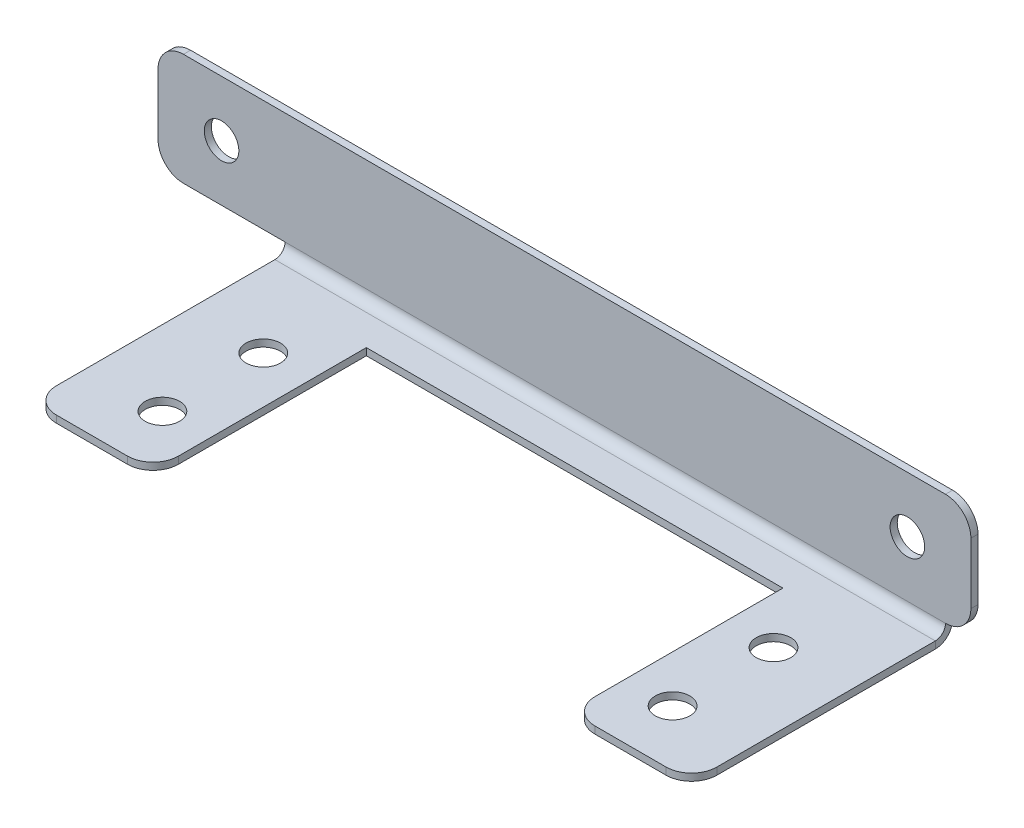
ISO-10303-21;
HEADER;
FILE_DESCRIPTION(('STEP AP214'),'2;1');
FILE_NAME('part.step','',(''),(''),'','','');
FILE_SCHEMA(('AUTOMOTIVE_DESIGN { 1 0 10303 214 1 1 1 1 }'));
ENDSEC;
DATA;
#1=APPLICATION_CONTEXT('core data for automotive mechanical design processes');
#2=APPLICATION_PROTOCOL_DEFINITION('international standard','automotive_design',2000,#1);
#3=PRODUCT_CONTEXT('',#1,'mechanical');
#4=PRODUCT('Part','Part','',(#3));
#5=PRODUCT_RELATED_PRODUCT_CATEGORY('part','',(#4));
#6=PRODUCT_DEFINITION_FORMATION('','',#4);
#7=PRODUCT_DEFINITION_CONTEXT('part definition',#1,'design');
#8=PRODUCT_DEFINITION('design','',#6,#7);
#9=PRODUCT_DEFINITION_SHAPE('','',#8);
#10=(LENGTH_UNIT() NAMED_UNIT(*) SI_UNIT(.MILLI.,.METRE.));
#11=(NAMED_UNIT(*) PLANE_ANGLE_UNIT() SI_UNIT($,.RADIAN.));
#12=(NAMED_UNIT(*) SI_UNIT($,.STERADIAN.) SOLID_ANGLE_UNIT());
#13=UNCERTAINTY_MEASURE_WITH_UNIT(LENGTH_MEASURE(1.E-05),#10,'distance_accuracy_value','');
#14=(GEOMETRIC_REPRESENTATION_CONTEXT(3) GLOBAL_UNCERTAINTY_ASSIGNED_CONTEXT((#13)) GLOBAL_UNIT_ASSIGNED_CONTEXT((#10,
#11,#12)) REPRESENTATION_CONTEXT('',''));
#15=CARTESIAN_POINT('',(0.,0.,0.));
#16=DIRECTION('',(0.,0.,1.));
#17=DIRECTION('',(1.,0.,0.));
#18=AXIS2_PLACEMENT_3D('',#15,#16,#17);
#19=CARTESIAN_POINT('',(-32.5,-0.7,12.));
#20=DIRECTION('',(0.,0.,1.));
#21=DIRECTION('',(1.,0.,0.));
#22=AXIS2_PLACEMENT_3D('',#19,#20,#21);
#23=PLANE('',#22);
#24=DIRECTION('',(1.,0.,0.));
#25=VECTOR('',#24,1.);
#26=CARTESIAN_POINT('',(-32.5,-0.7,12.));
#27=LINE('',#26,#25);
#28=CARTESIAN_POINT('',(-30.,-0.7,12.));
#29=VERTEX_POINT('',#28);
#30=CARTESIAN_POINT('',(-23.,-0.7,12.));
#31=VERTEX_POINT('',#30);
#32=EDGE_CURVE('E300',#29,#31,#27,.T.);
#33=ORIENTED_EDGE('',*,*,#32,.T.);
#34=DIRECTION('',(0.,1.,0.));
#35=VECTOR('',#34,1.);
#36=CARTESIAN_POINT('',(-23.,0.,12.));
#37=LINE('',#36,#35);
#38=CARTESIAN_POINT('',(-23.,0.,12.));
#39=VERTEX_POINT('',#38);
#40=EDGE_CURVE('E319',#31,#39,#37,.T.);
#41=ORIENTED_EDGE('',*,*,#40,.T.);
#42=DIRECTION('',(1.,0.,0.));
#43=VECTOR('',#42,1.);
#44=CARTESIAN_POINT('',(-32.5,0.,12.));
#45=LINE('',#44,#43);
#46=CARTESIAN_POINT('',(-30.,0.,12.));
#47=VERTEX_POINT('',#46);
#48=EDGE_CURVE('E291',#47,#39,#45,.T.);
#49=ORIENTED_EDGE('',*,*,#48,.F.);
#50=DIRECTION('',(0.,1.,0.));
#51=VECTOR('',#50,1.);
#52=CARTESIAN_POINT('',(-30.,-0.7,12.));
#53=LINE('',#52,#51);
#54=EDGE_CURVE('E314',#47,#29,#53,.F.);
#55=ORIENTED_EDGE('',*,*,#54,.T.);
#56=EDGE_LOOP('',(#33,#41,#49,#55));
#57=FACE_BOUND('',#56,.T.);
#58=ADVANCED_FACE('F56',(#57),#23,.T.);
#59=CARTESIAN_POINT('',(32.5,-0.7,-12.));
#60=DIRECTION('',(1.,0.,0.));
#61=DIRECTION('',(0.,0.,-1.));
#62=AXIS2_PLACEMENT_3D('',#59,#60,#61);
#63=PLANE('',#62);
#64=DIRECTION('',(0.,0.,-1.));
#65=VECTOR('',#64,1.);
#66=CARTESIAN_POINT('',(32.5,0.,-12.));
#67=LINE('',#66,#65);
#68=CARTESIAN_POINT('',(32.5,0.,9.5));
#69=VERTEX_POINT('',#68);
#70=CARTESIAN_POINT('',(32.5,0.,-12.));
#71=VERTEX_POINT('',#70);
#72=EDGE_CURVE('E279',#69,#71,#67,.T.);
#73=ORIENTED_EDGE('',*,*,#72,.F.);
#74=DIRECTION('',(0.,1.,0.));
#75=VECTOR('',#74,1.);
#76=CARTESIAN_POINT('',(32.5,-0.7,9.5));
#77=LINE('',#76,#75);
#78=CARTESIAN_POINT('',(32.5,-0.7,9.5));
#79=VERTEX_POINT('',#78);
#80=EDGE_CURVE('E348',#69,#79,#77,.F.);
#81=ORIENTED_EDGE('',*,*,#80,.T.);
#82=DIRECTION('',(0.,0.,-1.));
#83=VECTOR('',#82,1.);
#84=CARTESIAN_POINT('',(32.5,-0.7,-12.));
#85=LINE('',#84,#83);
#86=CARTESIAN_POINT('',(32.5,-0.7,-12.));
#87=VERTEX_POINT('',#86);
#88=EDGE_CURVE('E288',#79,#87,#85,.T.);
#89=ORIENTED_EDGE('',*,*,#88,.T.);
#90=DIRECTION('',(0.,1.,0.));
#91=VECTOR('',#90,1.);
#92=CARTESIAN_POINT('',(32.5,-0.7,-12.));
#93=LINE('',#92,#91);
#94=EDGE_CURVE('E315',#87,#71,#93,.T.);
#95=ORIENTED_EDGE('',*,*,#94,.T.);
#96=EDGE_LOOP('',(#73,#81,#89,#95));
#97=FACE_BOUND('',#96,.T.);
#98=ADVANCED_FACE('F432',(#97),#63,.T.);
#99=CARTESIAN_POINT('',(23.,-0.7,12.));
#100=VERTEX_POINT('',#99);
#101=CARTESIAN_POINT('',(30.,-0.7,12.));
#102=VERTEX_POINT('',#101);
#103=EDGE_CURVE('E297',#100,#102,#27,.T.);
#104=ORIENTED_EDGE('',*,*,#103,.T.);
#105=DIRECTION('',(0.,1.,0.));
#106=VECTOR('',#105,1.);
#107=CARTESIAN_POINT('',(30.,-0.7,12.));
#108=LINE('',#107,#106);
#109=CARTESIAN_POINT('',(30.,0.,12.));
#110=VERTEX_POINT('',#109);
#111=EDGE_CURVE('E345',#102,#110,#108,.T.);
#112=ORIENTED_EDGE('',*,*,#111,.T.);
#113=CARTESIAN_POINT('',(23.,0.,12.));
#114=VERTEX_POINT('',#113);
#115=EDGE_CURVE('E308',#114,#110,#45,.T.);
#116=ORIENTED_EDGE('',*,*,#115,.F.);
#117=DIRECTION('',(0.,1.,0.));
#118=VECTOR('',#117,1.);
#119=CARTESIAN_POINT('',(23.,-0.7,12.));
#120=LINE('',#119,#118);
#121=EDGE_CURVE('E343',#114,#100,#120,.F.);
#122=ORIENTED_EDGE('',*,*,#121,.T.);
#123=EDGE_LOOP('',(#104,#112,#116,#122));
#124=FACE_BOUND('',#123,.T.);
#125=ADVANCED_FACE('F440',(#124),#23,.T.);
#126=CARTESIAN_POINT('',(-32.5,-0.7,-12.));
#127=DIRECTION('',(-1.,0.,0.));
#128=DIRECTION('',(0.,0.,1.));
#129=AXIS2_PLACEMENT_3D('',#126,#127,#128);
#130=PLANE('',#129);
#131=DIRECTION('',(0.,0.,1.));
#132=VECTOR('',#131,1.);
#133=CARTESIAN_POINT('',(-32.5,-0.7,-12.));
#134=LINE('',#133,#132);
#135=CARTESIAN_POINT('',(-32.5,-0.700000000000011,-12.));
#136=VERTEX_POINT('',#135);
#137=CARTESIAN_POINT('',(-32.5,-0.7,9.5));
#138=VERTEX_POINT('',#137);
#139=EDGE_CURVE('E294',#136,#138,#134,.T.);
#140=ORIENTED_EDGE('',*,*,#139,.T.);
#141=DIRECTION('',(0.,1.,0.));
#142=VECTOR('',#141,1.);
#143=CARTESIAN_POINT('',(-32.5,-0.7,9.5));
#144=LINE('',#143,#142);
#145=CARTESIAN_POINT('',(-32.5,0.,9.5));
#146=VERTEX_POINT('',#145);
#147=EDGE_CURVE('E340',#138,#146,#144,.T.);
#148=ORIENTED_EDGE('',*,*,#147,.T.);
#149=DIRECTION('',(0.,0.,1.));
#150=VECTOR('',#149,1.);
#151=CARTESIAN_POINT('',(-32.5,0.,-12.));
#152=LINE('',#151,#150);
#153=CARTESIAN_POINT('',(-32.5,0.,-12.));
#154=VERTEX_POINT('',#153);
#155=EDGE_CURVE('E305',#154,#146,#152,.T.);
#156=ORIENTED_EDGE('',*,*,#155,.F.);
#157=DIRECTION('',(0.,1.,0.));
#158=VECTOR('',#157,1.);
#159=CARTESIAN_POINT('',(-32.5,-0.7,-12.));
#160=LINE('',#159,#158);
#161=EDGE_CURVE('E311',#136,#154,#160,.T.);
#162=ORIENTED_EDGE('',*,*,#161,.F.);
#163=EDGE_LOOP('',(#140,#148,#156,#162));
#164=FACE_BOUND('',#163,.T.);
#165=ADVANCED_FACE('F421',(#164),#130,.T.);
#166=CARTESIAN_POINT('',(0.,-0.7,0.));
#167=DIRECTION('',(0.,1.,0.));
#168=DIRECTION('',(0.,0.,1.));
#169=AXIS2_PLACEMENT_3D('',#166,#167,#168);
#170=PLANE('',#169);
#171=CARTESIAN_POINT('',(25.108,-0.7,-3.46550000000001));
#172=DIRECTION('',(0.,1.,0.));
#173=DIRECTION('',(0.,0.,1.));
#174=AXIS2_PLACEMENT_3D('',#171,#172,#173);
#175=CIRCLE('',#174,1.7);
#176=CARTESIAN_POINT('',(25.108,-0.7,-1.76550000000001));
#177=VERTEX_POINT('',#176);
#178=EDGE_CURVE('E562',#177,#177,#175,.F.);
#179=ORIENTED_EDGE('',*,*,#178,.F.);
#180=EDGE_LOOP('',(#179));
#181=FACE_BOUND('',#180,.T.);
#182=CARTESIAN_POINT('',(25.108,-0.7,6.46549999999999));
#183=DIRECTION('',(0.,1.,0.));
#184=DIRECTION('',(0.,0.,1.));
#185=AXIS2_PLACEMENT_3D('',#182,#183,#184);
#186=CIRCLE('',#185,1.7);
#187=CARTESIAN_POINT('',(25.108,-0.7,8.16549999999999));
#188=VERTEX_POINT('',#187);
#189=EDGE_CURVE('E566',#188,#188,#186,.F.);
#190=ORIENTED_EDGE('',*,*,#189,.F.);
#191=EDGE_LOOP('',(#190));
#192=FACE_BOUND('',#191,.T.);
#193=CARTESIAN_POINT('',(-25.108,-0.7,-3.46550000000001));
#194=DIRECTION('',(0.,1.,0.));
#195=DIRECTION('',(0.,0.,1.));
#196=AXIS2_PLACEMENT_3D('',#193,#194,#195);
#197=CIRCLE('',#196,1.7);
#198=CARTESIAN_POINT('',(-25.108,-0.7,-1.76550000000001));
#199=VERTEX_POINT('',#198);
#200=EDGE_CURVE('E575',#199,#199,#197,.F.);
#201=ORIENTED_EDGE('',*,*,#200,.F.);
#202=EDGE_LOOP('',(#201));
#203=FACE_BOUND('',#202,.T.);
#204=CARTESIAN_POINT('',(-25.108,-0.7,6.46549999999999));
#205=DIRECTION('',(0.,1.,0.));
#206=DIRECTION('',(0.,0.,1.));
#207=AXIS2_PLACEMENT_3D('',#204,#205,#206);
#208=CIRCLE('',#207,1.7);
#209=CARTESIAN_POINT('',(-25.108,-0.7,8.16549999999999));
#210=VERTEX_POINT('',#209);
#211=EDGE_CURVE('E446',#210,#210,#208,.F.);
#212=ORIENTED_EDGE('',*,*,#211,.F.);
#213=EDGE_LOOP('',(#212));
#214=FACE_BOUND('',#213,.T.);
#215=DIRECTION('',(0.,0.,-1.));
#216=VECTOR('',#215,1.);
#217=CARTESIAN_POINT('',(-20.5,-0.7,12.));
#218=LINE('',#217,#216);
#219=CARTESIAN_POINT('',(-20.5,-0.7,9.5));
#220=VERTEX_POINT('',#219);
#221=CARTESIAN_POINT('',(-20.5,-0.7,-9.00000000000001));
#222=VERTEX_POINT('',#221);
#223=EDGE_CURVE('E448',#220,#222,#218,.T.);
#224=ORIENTED_EDGE('',*,*,#223,.F.);
#225=CARTESIAN_POINT('',(-23.,-0.7,9.5));
#226=DIRECTION('',(0.,1.,0.));
#227=DIRECTION('',(0.,0.,1.));
#228=AXIS2_PLACEMENT_3D('',#225,#226,#227);
#229=CIRCLE('',#228,2.5);
#230=EDGE_CURVE('E338',#220,#31,#229,.F.);
#231=ORIENTED_EDGE('',*,*,#230,.T.);
#232=ORIENTED_EDGE('',*,*,#32,.F.);
#233=CARTESIAN_POINT('',(-30.,-0.7,9.5));
#234=DIRECTION('',(0.,1.,0.));
#235=DIRECTION('',(0.,0.,1.));
#236=AXIS2_PLACEMENT_3D('',#233,#234,#235);
#237=CIRCLE('',#236,2.5);
#238=EDGE_CURVE('E336',#29,#138,#237,.F.);
#239=ORIENTED_EDGE('',*,*,#238,.T.);
#240=ORIENTED_EDGE('',*,*,#139,.F.);
#241=DIRECTION('',(-1.,0.,0.));
#242=VECTOR('',#241,1.);
#243=CARTESIAN_POINT('',(-32.5,-0.7,-12.));
#244=LINE('',#243,#242);
#245=EDGE_CURVE('E290',#87,#136,#244,.T.);
#246=ORIENTED_EDGE('',*,*,#245,.F.);
#247=ORIENTED_EDGE('',*,*,#88,.F.);
#248=CARTESIAN_POINT('',(30.,-0.7,9.5));
#249=DIRECTION('',(0.,1.,0.));
#250=DIRECTION('',(0.,0.,1.));
#251=AXIS2_PLACEMENT_3D('',#248,#249,#250);
#252=CIRCLE('',#251,2.5);
#253=EDGE_CURVE('E334',#79,#102,#252,.F.);
#254=ORIENTED_EDGE('',*,*,#253,.T.);
#255=ORIENTED_EDGE('',*,*,#103,.F.);
#256=CARTESIAN_POINT('',(23.,-0.7,9.5));
#257=DIRECTION('',(0.,1.,0.));
#258=DIRECTION('',(0.,0.,1.));
#259=AXIS2_PLACEMENT_3D('',#256,#257,#258);
#260=CIRCLE('',#259,2.5);
#261=CARTESIAN_POINT('',(20.5,-0.7,9.5));
#262=VERTEX_POINT('',#261);
#263=EDGE_CURVE('E332',#100,#262,#260,.F.);
#264=ORIENTED_EDGE('',*,*,#263,.T.);
#265=DIRECTION('',(0.,0.,1.));
#266=VECTOR('',#265,1.);
#267=CARTESIAN_POINT('',(20.5,-0.7,12.));
#268=LINE('',#267,#266);
#269=CARTESIAN_POINT('',(20.5,-0.7,-9.00000000000002));
#270=VERTEX_POINT('',#269);
#271=EDGE_CURVE('E445',#270,#262,#268,.T.);
#272=ORIENTED_EDGE('',*,*,#271,.F.);
#273=DIRECTION('',(1.,0.,0.));
#274=VECTOR('',#273,1.);
#275=CARTESIAN_POINT('',(-20.5,-0.7,-9.00000000000001));
#276=LINE('',#275,#274);
#277=EDGE_CURVE('E219',#222,#270,#276,.T.);
#278=ORIENTED_EDGE('',*,*,#277,.F.);
#279=EDGE_LOOP('',(#224,#231,#232,#239,#240,#246,#247,#254,#255,#264,#272,#278));
#280=FACE_BOUND('',#279,.T.);
#281=ADVANCED_FACE('F429',(#181,#192,#203,#214,#280),#170,.F.);
#282=CARTESIAN_POINT('',(0.,0.,0.));
#283=DIRECTION('',(0.,1.,0.));
#284=DIRECTION('',(0.,0.,1.));
#285=AXIS2_PLACEMENT_3D('',#282,#283,#284);
#286=PLANE('',#285);
#287=CARTESIAN_POINT('',(25.108,0.,-3.46550000000001));
#288=DIRECTION('',(0.,1.,0.));
#289=DIRECTION('',(0.,0.,1.));
#290=AXIS2_PLACEMENT_3D('',#287,#288,#289);
#291=CIRCLE('',#290,1.7);
#292=CARTESIAN_POINT('',(25.108,0.,-1.76550000000001));
#293=VERTEX_POINT('',#292);
#294=EDGE_CURVE('E560',#293,#293,#291,.T.);
#295=ORIENTED_EDGE('',*,*,#294,.F.);
#296=EDGE_LOOP('',(#295));
#297=FACE_BOUND('',#296,.T.);
#298=CARTESIAN_POINT('',(25.108,0.,6.46549999999999));
#299=DIRECTION('',(0.,1.,0.));
#300=DIRECTION('',(0.,0.,-1.));
#301=AXIS2_PLACEMENT_3D('',#298,#299,#300);
#302=CIRCLE('',#301,1.7);
#303=CARTESIAN_POINT('',(25.108,0.,4.76549999999999));
#304=VERTEX_POINT('',#303);
#305=EDGE_CURVE('E563',#304,#304,#302,.T.);
#306=ORIENTED_EDGE('',*,*,#305,.F.);
#307=EDGE_LOOP('',(#306));
#308=FACE_BOUND('',#307,.T.);
#309=CARTESIAN_POINT('',(-25.108,0.,-3.46550000000001));
#310=DIRECTION('',(0.,1.,0.));
#311=DIRECTION('',(0.,0.,-1.));
#312=AXIS2_PLACEMENT_3D('',#309,#310,#311);
#313=CIRCLE('',#312,1.7);
#314=CARTESIAN_POINT('',(-25.108,0.,-5.16550000000001));
#315=VERTEX_POINT('',#314);
#316=EDGE_CURVE('E572',#315,#315,#313,.T.);
#317=ORIENTED_EDGE('',*,*,#316,.F.);
#318=EDGE_LOOP('',(#317));
#319=FACE_BOUND('',#318,.T.);
#320=CARTESIAN_POINT('',(-25.108,0.,6.46549999999999));
#321=DIRECTION('',(0.,1.,0.));
#322=DIRECTION('',(0.,0.,1.));
#323=AXIS2_PLACEMENT_3D('',#320,#321,#322);
#324=CIRCLE('',#323,1.7);
#325=CARTESIAN_POINT('',(-25.108,0.,8.16549999999999));
#326=VERTEX_POINT('',#325);
#327=EDGE_CURVE('E451',#326,#326,#324,.T.);
#328=ORIENTED_EDGE('',*,*,#327,.F.);
#329=EDGE_LOOP('',(#328));
#330=FACE_BOUND('',#329,.T.);
#331=ORIENTED_EDGE('',*,*,#48,.T.);
#332=CARTESIAN_POINT('',(-23.,0.,9.5));
#333=DIRECTION('',(0.,1.,0.));
#334=DIRECTION('',(0.,0.,1.));
#335=AXIS2_PLACEMENT_3D('',#332,#333,#334);
#336=CIRCLE('',#335,2.5);
#337=CARTESIAN_POINT('',(-20.5,0.,9.5));
#338=VERTEX_POINT('',#337);
#339=EDGE_CURVE('E328',#39,#338,#336,.T.);
#340=ORIENTED_EDGE('',*,*,#339,.T.);
#341=DIRECTION('',(0.,0.,1.));
#342=VECTOR('',#341,1.);
#343=CARTESIAN_POINT('',(-20.5,0.,12.));
#344=LINE('',#343,#342);
#345=CARTESIAN_POINT('',(-20.5,0.,-9.00000000000001));
#346=VERTEX_POINT('',#345);
#347=EDGE_CURVE('E211',#346,#338,#344,.T.);
#348=ORIENTED_EDGE('',*,*,#347,.F.);
#349=DIRECTION('',(-1.,0.,0.));
#350=VECTOR('',#349,1.);
#351=CARTESIAN_POINT('',(-20.5,0.,-9.00000000000001));
#352=LINE('',#351,#350);
#353=CARTESIAN_POINT('',(20.5,0.,-9.00000000000002));
#354=VERTEX_POINT('',#353);
#355=EDGE_CURVE('E210',#354,#346,#352,.T.);
#356=ORIENTED_EDGE('',*,*,#355,.F.);
#357=DIRECTION('',(0.,0.,-1.));
#358=VECTOR('',#357,1.);
#359=CARTESIAN_POINT('',(20.5,0.,12.));
#360=LINE('',#359,#358);
#361=CARTESIAN_POINT('',(20.5,0.,9.5));
#362=VERTEX_POINT('',#361);
#363=EDGE_CURVE('E200',#362,#354,#360,.T.);
#364=ORIENTED_EDGE('',*,*,#363,.F.);
#365=CARTESIAN_POINT('',(23.,0.,9.5));
#366=DIRECTION('',(0.,1.,0.));
#367=DIRECTION('',(0.,0.,1.));
#368=AXIS2_PLACEMENT_3D('',#365,#366,#367);
#369=CIRCLE('',#368,2.5);
#370=EDGE_CURVE('E322',#362,#114,#369,.T.);
#371=ORIENTED_EDGE('',*,*,#370,.T.);
#372=ORIENTED_EDGE('',*,*,#115,.T.);
#373=CARTESIAN_POINT('',(30.,0.,9.5));
#374=DIRECTION('',(0.,1.,0.));
#375=DIRECTION('',(0.,0.,1.));
#376=AXIS2_PLACEMENT_3D('',#373,#374,#375);
#377=CIRCLE('',#376,2.5);
#378=EDGE_CURVE('E324',#110,#69,#377,.T.);
#379=ORIENTED_EDGE('',*,*,#378,.T.);
#380=ORIENTED_EDGE('',*,*,#72,.T.);
#381=DIRECTION('',(-1.,0.,0.));
#382=VECTOR('',#381,1.);
#383=CARTESIAN_POINT('',(-32.5,0.,-12.));
#384=LINE('',#383,#382);
#385=EDGE_CURVE('E302',#71,#154,#384,.T.);
#386=ORIENTED_EDGE('',*,*,#385,.T.);
#387=ORIENTED_EDGE('',*,*,#155,.T.);
#388=CARTESIAN_POINT('',(-30.,0.,9.5));
#389=DIRECTION('',(0.,1.,0.));
#390=DIRECTION('',(0.,0.,1.));
#391=AXIS2_PLACEMENT_3D('',#388,#389,#390);
#392=CIRCLE('',#391,2.5);
#393=EDGE_CURVE('E326',#146,#47,#392,.T.);
#394=ORIENTED_EDGE('',*,*,#393,.T.);
#395=EDGE_LOOP('',(#331,#340,#348,#356,#364,#371,#372,#379,#380,#386,#387,#394));
#396=FACE_BOUND('',#395,.T.);
#397=ADVANCED_FACE('F224',(#297,#308,#319,#330,#396),#286,.T.);
#398=CARTESIAN_POINT('',(32.5,0.999999999999989,-12.));
#399=DIRECTION('',(1.,0.,0.));
#400=DIRECTION('',(0.,0.,-1.));
#401=AXIS2_PLACEMENT_3D('',#398,#399,#400);
#402=PLANE('',#401);
#403=DIRECTION('',(0.,0.,1.));
#404=VECTOR('',#403,1.);
#405=CARTESIAN_POINT('',(32.5,1.,-13.7));
#406=LINE('',#405,#404);
#407=CARTESIAN_POINT('',(32.5,0.999999999999985,-13.));
#408=VERTEX_POINT('',#407);
#409=CARTESIAN_POINT('',(32.5,0.999999999999983,-13.7));
#410=VERTEX_POINT('',#409);
#411=EDGE_CURVE('E255',#408,#410,#406,.F.);
#412=ORIENTED_EDGE('',*,*,#411,.F.);
#413=CARTESIAN_POINT('',(32.5,0.999999999999989,-12.));
#414=DIRECTION('',(-1.,0.,0.));
#415=DIRECTION('',(0.,0.,1.));
#416=AXIS2_PLACEMENT_3D('',#413,#414,#415);
#417=CIRCLE('',#416,0.999999999999999);
#418=EDGE_CURVE('E283',#71,#408,#417,.F.);
#419=ORIENTED_EDGE('',*,*,#418,.F.);
#420=ORIENTED_EDGE('',*,*,#94,.F.);
#421=CARTESIAN_POINT('',(32.5,0.999999999999989,-12.));
#422=DIRECTION('',(-1.,0.,0.));
#423=DIRECTION('',(0.,0.,1.));
#424=AXIS2_PLACEMENT_3D('',#421,#422,#423);
#425=CIRCLE('',#424,1.7);
#426=EDGE_CURVE('E276',#87,#410,#425,.F.);
#427=ORIENTED_EDGE('',*,*,#426,.T.);
#428=EDGE_LOOP('',(#412,#419,#420,#427));
#429=FACE_BOUND('',#428,.T.);
#430=ADVANCED_FACE('F408',(#429),#402,.T.);
#431=CARTESIAN_POINT('',(-32.5,0.999999999999989,-12.));
#432=DIRECTION('',(1.,0.,0.));
#433=DIRECTION('',(0.,0.,-1.));
#434=AXIS2_PLACEMENT_3D('',#431,#432,#433);
#435=PLANE('',#434);
#436=CARTESIAN_POINT('',(-32.5,0.999999999999989,-12.));
#437=DIRECTION('',(-1.,0.,0.));
#438=DIRECTION('',(0.,0.,1.));
#439=AXIS2_PLACEMENT_3D('',#436,#437,#438);
#440=CIRCLE('',#439,0.999999999999999);
#441=CARTESIAN_POINT('',(-32.5,0.999999999999985,-13.));
#442=VERTEX_POINT('',#441);
#443=EDGE_CURVE('E261',#442,#154,#440,.T.);
#444=ORIENTED_EDGE('',*,*,#443,.F.);
#445=DIRECTION('',(0.,0.,1.));
#446=VECTOR('',#445,1.);
#447=CARTESIAN_POINT('',(-32.5,0.999999999999996,-13.));
#448=LINE('',#447,#446);
#449=CARTESIAN_POINT('',(-32.5,0.999999999999985,-13.7));
#450=VERTEX_POINT('',#449);
#451=EDGE_CURVE('E268',#442,#450,#448,.F.);
#452=ORIENTED_EDGE('',*,*,#451,.T.);
#453=CARTESIAN_POINT('',(-32.5,0.999999999999989,-12.));
#454=DIRECTION('',(-1.,0.,0.));
#455=DIRECTION('',(0.,0.,1.));
#456=AXIS2_PLACEMENT_3D('',#453,#454,#455);
#457=CIRCLE('',#456,1.7);
#458=EDGE_CURVE('E280',#450,#136,#457,.T.);
#459=ORIENTED_EDGE('',*,*,#458,.T.);
#460=ORIENTED_EDGE('',*,*,#161,.T.);
#461=EDGE_LOOP('',(#444,#452,#459,#460));
#462=FACE_BOUND('',#461,.T.);
#463=ADVANCED_FACE('F418',(#462),#435,.F.);
#464=CARTESIAN_POINT('',(-32.5,0.999999999999989,-12.));
#465=DIRECTION('',(-1.,0.,0.));
#466=DIRECTION('',(0.,0.,-1.));
#467=AXIS2_PLACEMENT_3D('',#464,#465,#466);
#468=CYLINDRICAL_SURFACE('',#467,1.7);
#469=ORIENTED_EDGE('',*,*,#245,.T.);
#470=ORIENTED_EDGE('',*,*,#458,.F.);
#471=DIRECTION('',(-1.,0.,0.));
#472=VECTOR('',#471,1.);
#473=CARTESIAN_POINT('',(32.5,1.,-13.7));
#474=LINE('',#473,#472);
#475=EDGE_CURVE('E265',#450,#410,#474,.F.);
#476=ORIENTED_EDGE('',*,*,#475,.T.);
#477=ORIENTED_EDGE('',*,*,#426,.F.);
#478=EDGE_LOOP('',(#469,#470,#476,#477));
#479=FACE_BOUND('',#478,.T.);
#480=ADVANCED_FACE('F425',(#479),#468,.T.);
#481=CARTESIAN_POINT('',(-32.5,0.999999999999989,-12.));
#482=DIRECTION('',(-1.,0.,0.));
#483=DIRECTION('',(0.,0.,-1.));
#484=AXIS2_PLACEMENT_3D('',#481,#482,#483);
#485=CYLINDRICAL_SURFACE('',#484,0.999999999999999);
#486=ORIENTED_EDGE('',*,*,#385,.F.);
#487=ORIENTED_EDGE('',*,*,#418,.T.);
#488=DIRECTION('',(-1.,0.,0.));
#489=VECTOR('',#488,1.);
#490=CARTESIAN_POINT('',(32.5,0.999999999999996,-13.));
#491=LINE('',#490,#489);
#492=EDGE_CURVE('E271',#408,#442,#491,.T.);
#493=ORIENTED_EDGE('',*,*,#492,.T.);
#494=ORIENTED_EDGE('',*,*,#443,.T.);
#495=EDGE_LOOP('',(#486,#487,#493,#494));
#496=FACE_BOUND('',#495,.T.);
#497=ADVANCED_FACE('F413',(#496),#485,.F.);
#498=CARTESIAN_POINT('',(0.,0.,-13.7));
#499=DIRECTION('',(0.,0.,1.));
#500=DIRECTION('',(0.,-1.,0.));
#501=AXIS2_PLACEMENT_3D('',#498,#499,#500);
#502=PLANE('',#501);
#503=CARTESIAN_POINT('',(28.75,6.5,-13.7));
#504=DIRECTION('',(0.,0.,1.));
#505=DIRECTION('',(0.,-1.,0.));
#506=AXIS2_PLACEMENT_3D('',#503,#504,#505);
#507=CIRCLE('',#506,1.7);
#508=CARTESIAN_POINT('',(28.75,4.8,-13.7));
#509=VERTEX_POINT('',#508);
#510=EDGE_CURVE('E233',#509,#509,#507,.F.);
#511=ORIENTED_EDGE('',*,*,#510,.F.);
#512=EDGE_LOOP('',(#511));
#513=FACE_BOUND('',#512,.T.);
#514=CARTESIAN_POINT('',(-38.75,6.49999999999999,-13.7));
#515=DIRECTION('',(0.,0.,1.));
#516=DIRECTION('',(0.,-1.,0.));
#517=AXIS2_PLACEMENT_3D('',#514,#515,#516);
#518=CIRCLE('',#517,1.7);
#519=CARTESIAN_POINT('',(-38.75,4.79999999999999,-13.7));
#520=VERTEX_POINT('',#519);
#521=EDGE_CURVE('E239',#520,#520,#518,.F.);
#522=ORIENTED_EDGE('',*,*,#521,.F.);
#523=EDGE_LOOP('',(#522));
#524=FACE_BOUND('',#523,.T.);
#525=DIRECTION('',(1.,0.,0.));
#526=VECTOR('',#525,1.);
#527=CARTESIAN_POINT('',(0.,12.,-13.7));
#528=LINE('',#527,#526);
#529=CARTESIAN_POINT('',(-42.5,12.,-13.7));
#530=VERTEX_POINT('',#529);
#531=CARTESIAN_POINT('',(32.5,12.,-13.7));
#532=VERTEX_POINT('',#531);
#533=EDGE_CURVE('E258',#530,#532,#528,.T.);
#534=ORIENTED_EDGE('',*,*,#533,.T.);
#535=CARTESIAN_POINT('',(32.5,9.5,-13.7));
#536=DIRECTION('',(0.,0.,1.));
#537=DIRECTION('',(0.,-1.,0.));
#538=AXIS2_PLACEMENT_3D('',#535,#536,#537);
#539=CIRCLE('',#538,2.5);
#540=CARTESIAN_POINT('',(35.,9.5,-13.7));
#541=VERTEX_POINT('',#540);
#542=EDGE_CURVE('E374',#532,#541,#539,.F.);
#543=ORIENTED_EDGE('',*,*,#542,.T.);
#544=DIRECTION('',(0.,1.,0.));
#545=VECTOR('',#544,1.);
#546=CARTESIAN_POINT('',(35.,12.,-13.7));
#547=LINE('',#546,#545);
#548=CARTESIAN_POINT('',(35.,3.49999999999999,-13.7));
#549=VERTEX_POINT('',#548);
#550=EDGE_CURVE('E252',#549,#541,#547,.T.);
#551=ORIENTED_EDGE('',*,*,#550,.F.);
#552=CARTESIAN_POINT('',(32.5,3.49999999999999,-13.7));
#553=DIRECTION('',(0.,0.,1.));
#554=DIRECTION('',(0.,-1.,0.));
#555=AXIS2_PLACEMENT_3D('',#552,#553,#554);
#556=CIRCLE('',#555,2.5);
#557=EDGE_CURVE('E372',#549,#410,#556,.F.);
#558=ORIENTED_EDGE('',*,*,#557,.T.);
#559=ORIENTED_EDGE('',*,*,#475,.F.);
#560=DIRECTION('',(1.,0.,0.));
#561=VECTOR('',#560,1.);
#562=CARTESIAN_POINT('',(-32.5,0.999999999999985,-13.7));
#563=LINE('',#562,#561);
#564=CARTESIAN_POINT('',(-42.5,0.999999999999984,-13.7));
#565=VERTEX_POINT('',#564);
#566=EDGE_CURVE('E245',#565,#450,#563,.T.);
#567=ORIENTED_EDGE('',*,*,#566,.F.);
#568=CARTESIAN_POINT('',(-42.5,3.49999999999998,-13.7));
#569=DIRECTION('',(0.,0.,1.));
#570=DIRECTION('',(0.,-1.,0.));
#571=AXIS2_PLACEMENT_3D('',#568,#569,#570);
#572=CIRCLE('',#571,2.5);
#573=CARTESIAN_POINT('',(-45.,3.49999999999999,-13.7));
#574=VERTEX_POINT('',#573);
#575=EDGE_CURVE('E71',#565,#574,#572,.F.);
#576=ORIENTED_EDGE('',*,*,#575,.T.);
#577=DIRECTION('',(0.,-1.,0.));
#578=VECTOR('',#577,1.);
#579=CARTESIAN_POINT('',(-45.,12.,-13.7));
#580=LINE('',#579,#578);
#581=CARTESIAN_POINT('',(-45.,9.5,-13.7));
#582=VERTEX_POINT('',#581);
#583=EDGE_CURVE('E243',#582,#574,#580,.T.);
#584=ORIENTED_EDGE('',*,*,#583,.F.);
#585=CARTESIAN_POINT('',(-42.5,9.5,-13.7));
#586=DIRECTION('',(0.,0.,1.));
#587=DIRECTION('',(0.,-1.,0.));
#588=AXIS2_PLACEMENT_3D('',#585,#586,#587);
#589=CIRCLE('',#588,2.5);
#590=EDGE_CURVE('E369',#582,#530,#589,.F.);
#591=ORIENTED_EDGE('',*,*,#590,.T.);
#592=EDGE_LOOP('',(#534,#543,#551,#558,#559,#567,#576,#584,#591));
#593=FACE_BOUND('',#592,.T.);
#594=ADVANCED_FACE('F392',(#513,#524,#593),#502,.F.);
#595=CARTESIAN_POINT('',(0.,0.,-13.));
#596=DIRECTION('',(0.,0.,1.));
#597=DIRECTION('',(0.,-1.,0.));
#598=AXIS2_PLACEMENT_3D('',#595,#596,#597);
#599=PLANE('',#598);
#600=CARTESIAN_POINT('',(28.75,6.5,-13.));
#601=DIRECTION('',(0.,0.,1.));
#602=DIRECTION('',(-1.,0.,0.));
#603=AXIS2_PLACEMENT_3D('',#600,#601,#602);
#604=CIRCLE('',#603,1.7);
#605=CARTESIAN_POINT('',(27.05,6.5,-13.));
#606=VERTEX_POINT('',#605);
#607=EDGE_CURVE('E229',#606,#606,#604,.T.);
#608=ORIENTED_EDGE('',*,*,#607,.F.);
#609=EDGE_LOOP('',(#608));
#610=FACE_BOUND('',#609,.T.);
#611=CARTESIAN_POINT('',(-38.75,6.49999999999999,-13.));
#612=DIRECTION('',(0.,0.,1.));
#613=DIRECTION('',(1.,0.,0.));
#614=AXIS2_PLACEMENT_3D('',#611,#612,#613);
#615=CIRCLE('',#614,1.7);
#616=CARTESIAN_POINT('',(-37.05,6.49999999999999,-13.));
#617=VERTEX_POINT('',#616);
#618=EDGE_CURVE('E236',#617,#617,#615,.T.);
#619=ORIENTED_EDGE('',*,*,#618,.F.);
#620=EDGE_LOOP('',(#619));
#621=FACE_BOUND('',#620,.T.);
#622=DIRECTION('',(0.,1.,0.));
#623=VECTOR('',#622,1.);
#624=CARTESIAN_POINT('',(35.,12.,-13.));
#625=LINE('',#624,#623);
#626=CARTESIAN_POINT('',(35.,3.49999999999999,-13.));
#627=VERTEX_POINT('',#626);
#628=CARTESIAN_POINT('',(35.,9.5,-13.));
#629=VERTEX_POINT('',#628);
#630=EDGE_CURVE('E248',#627,#629,#625,.T.);
#631=ORIENTED_EDGE('',*,*,#630,.T.);
#632=CARTESIAN_POINT('',(32.5,9.5,-13.));
#633=DIRECTION('',(0.,0.,1.));
#634=DIRECTION('',(0.,-1.,0.));
#635=AXIS2_PLACEMENT_3D('',#632,#633,#634);
#636=CIRCLE('',#635,2.5);
#637=CARTESIAN_POINT('',(32.5,12.,-13.));
#638=VERTEX_POINT('',#637);
#639=EDGE_CURVE('E362',#629,#638,#636,.T.);
#640=ORIENTED_EDGE('',*,*,#639,.T.);
#641=DIRECTION('',(-1.,0.,0.));
#642=VECTOR('',#641,1.);
#643=CARTESIAN_POINT('',(32.5,12.,-13.));
#644=LINE('',#643,#642);
#645=CARTESIAN_POINT('',(-42.5,12.,-13.));
#646=VERTEX_POINT('',#645);
#647=EDGE_CURVE('E262',#646,#638,#644,.F.);
#648=ORIENTED_EDGE('',*,*,#647,.F.);
#649=CARTESIAN_POINT('',(-42.5,9.5,-13.));
#650=DIRECTION('',(0.,0.,1.));
#651=DIRECTION('',(0.,-1.,0.));
#652=AXIS2_PLACEMENT_3D('',#649,#650,#651);
#653=CIRCLE('',#652,2.5);
#654=CARTESIAN_POINT('',(-45.,9.5,-13.));
#655=VERTEX_POINT('',#654);
#656=EDGE_CURVE('E356',#646,#655,#653,.T.);
#657=ORIENTED_EDGE('',*,*,#656,.T.);
#658=DIRECTION('',(0.,-1.,0.));
#659=VECTOR('',#658,1.);
#660=CARTESIAN_POINT('',(-45.,12.,-13.));
#661=LINE('',#660,#659);
#662=CARTESIAN_POINT('',(-45.,3.49999999999999,-13.));
#663=VERTEX_POINT('',#662);
#664=EDGE_CURVE('E242',#655,#663,#661,.T.);
#665=ORIENTED_EDGE('',*,*,#664,.T.);
#666=CARTESIAN_POINT('',(-42.5,3.49999999999998,-13.));
#667=DIRECTION('',(0.,0.,1.));
#668=DIRECTION('',(0.,-1.,0.));
#669=AXIS2_PLACEMENT_3D('',#666,#667,#668);
#670=CIRCLE('',#669,2.5);
#671=CARTESIAN_POINT('',(-42.5,0.999999999999984,-13.));
#672=VERTEX_POINT('',#671);
#673=EDGE_CURVE('E358',#663,#672,#670,.T.);
#674=ORIENTED_EDGE('',*,*,#673,.T.);
#675=DIRECTION('',(1.,0.,0.));
#676=VECTOR('',#675,1.);
#677=CARTESIAN_POINT('',(-32.5,0.999999999999985,-13.));
#678=LINE('',#677,#676);
#679=EDGE_CURVE('E246',#672,#442,#678,.T.);
#680=ORIENTED_EDGE('',*,*,#679,.T.);
#681=ORIENTED_EDGE('',*,*,#492,.F.);
#682=CARTESIAN_POINT('',(32.5,3.49999999999999,-13.));
#683=DIRECTION('',(0.,0.,1.));
#684=DIRECTION('',(0.,-1.,0.));
#685=AXIS2_PLACEMENT_3D('',#682,#683,#684);
#686=CIRCLE('',#685,2.5);
#687=EDGE_CURVE('E360',#408,#627,#686,.T.);
#688=ORIENTED_EDGE('',*,*,#687,.T.);
#689=EDGE_LOOP('',(#631,#640,#648,#657,#665,#674,#680,#681,#688));
#690=FACE_BOUND('',#689,.T.);
#691=ADVANCED_FACE('F381',(#610,#621,#690),#599,.T.);
#692=CARTESIAN_POINT('',(32.5,12.,-13.7));
#693=DIRECTION('',(0.,-1.,0.));
#694=DIRECTION('',(0.,0.,-1.));
#695=AXIS2_PLACEMENT_3D('',#692,#693,#694);
#696=PLANE('',#695);
#697=ORIENTED_EDGE('',*,*,#647,.T.);
#698=DIRECTION('',(0.,0.,1.));
#699=VECTOR('',#698,1.);
#700=CARTESIAN_POINT('',(32.5,12.,-13.7));
#701=LINE('',#700,#699);
#702=EDGE_CURVE('E367',#638,#532,#701,.F.);
#703=ORIENTED_EDGE('',*,*,#702,.T.);
#704=ORIENTED_EDGE('',*,*,#533,.F.);
#705=DIRECTION('',(0.,0.,1.));
#706=VECTOR('',#705,1.);
#707=CARTESIAN_POINT('',(-42.5,12.,-13.));
#708=LINE('',#707,#706);
#709=EDGE_CURVE('E364',#530,#646,#708,.T.);
#710=ORIENTED_EDGE('',*,*,#709,.T.);
#711=EDGE_LOOP('',(#697,#703,#704,#710));
#712=FACE_BOUND('',#711,.T.);
#713=ADVANCED_FACE('F389',(#712),#696,.F.);
#714=CARTESIAN_POINT('',(35.,12.,-13.7));
#715=DIRECTION('',(1.,0.,0.));
#716=DIRECTION('',(0.,0.,-1.));
#717=AXIS2_PLACEMENT_3D('',#714,#715,#716);
#718=PLANE('',#717);
#719=ORIENTED_EDGE('',*,*,#550,.T.);
#720=DIRECTION('',(0.,0.,1.));
#721=VECTOR('',#720,1.);
#722=CARTESIAN_POINT('',(35.,9.5,-13.));
#723=LINE('',#722,#721);
#724=EDGE_CURVE('E353',#541,#629,#723,.T.);
#725=ORIENTED_EDGE('',*,*,#724,.T.);
#726=ORIENTED_EDGE('',*,*,#630,.F.);
#727=DIRECTION('',(0.,0.,1.));
#728=VECTOR('',#727,1.);
#729=CARTESIAN_POINT('',(35.,3.49999999999999,-13.7));
#730=LINE('',#729,#728);
#731=EDGE_CURVE('E351',#627,#549,#730,.F.);
#732=ORIENTED_EDGE('',*,*,#731,.T.);
#733=EDGE_LOOP('',(#719,#725,#726,#732));
#734=FACE_BOUND('',#733,.T.);
#735=ADVANCED_FACE('F399',(#734),#718,.T.);
#736=CARTESIAN_POINT('',(-32.5,0.999999999999985,-13.7));
#737=DIRECTION('',(0.,-1.,0.));
#738=DIRECTION('',(1.,0.,0.));
#739=AXIS2_PLACEMENT_3D('',#736,#737,#738);
#740=PLANE('',#739);
#741=ORIENTED_EDGE('',*,*,#679,.F.);
#742=DIRECTION('',(0.,0.,1.));
#743=VECTOR('',#742,1.);
#744=CARTESIAN_POINT('',(-42.5,0.999999999999984,-13.7));
#745=LINE('',#744,#743);
#746=EDGE_CURVE('E13',#672,#565,#745,.F.);
#747=ORIENTED_EDGE('',*,*,#746,.T.);
#748=ORIENTED_EDGE('',*,*,#566,.T.);
#749=ORIENTED_EDGE('',*,*,#451,.F.);
#750=EDGE_LOOP('',(#741,#747,#748,#749));
#751=FACE_BOUND('',#750,.T.);
#752=ADVANCED_FACE('F521',(#751),#740,.T.);
#753=CARTESIAN_POINT('',(-45.,12.,-13.7));
#754=DIRECTION('',(-1.,0.,0.));
#755=DIRECTION('',(0.,0.,1.));
#756=AXIS2_PLACEMENT_3D('',#753,#754,#755);
#757=PLANE('',#756);
#758=ORIENTED_EDGE('',*,*,#583,.T.);
#759=DIRECTION('',(0.,0.,1.));
#760=VECTOR('',#759,1.);
#761=CARTESIAN_POINT('',(-45.,3.49999999999998,-13.7));
#762=LINE('',#761,#760);
#763=EDGE_CURVE('E64',#574,#663,#762,.T.);
#764=ORIENTED_EDGE('',*,*,#763,.T.);
#765=ORIENTED_EDGE('',*,*,#664,.F.);
#766=DIRECTION('',(0.,0.,1.));
#767=VECTOR('',#766,1.);
#768=CARTESIAN_POINT('',(-45.,9.5,-13.7));
#769=LINE('',#768,#767);
#770=EDGE_CURVE('E78',#655,#582,#769,.F.);
#771=ORIENTED_EDGE('',*,*,#770,.T.);
#772=EDGE_LOOP('',(#758,#764,#765,#771));
#773=FACE_BOUND('',#772,.T.);
#774=ADVANCED_FACE('F378',(#773),#757,.T.);
#775=CARTESIAN_POINT('',(-38.75,6.49999999999999,-13.701));
#776=DIRECTION('',(0.,0.,1.));
#777=DIRECTION('',(1.,0.,0.));
#778=AXIS2_PLACEMENT_3D('',#775,#776,#777);
#779=CYLINDRICAL_SURFACE('',#778,1.7);
#780=ORIENTED_EDGE('',*,*,#618,.T.);
#781=EDGE_LOOP('',(#780));
#782=FACE_BOUND('',#781,.T.);
#783=ORIENTED_EDGE('',*,*,#521,.T.);
#784=EDGE_LOOP('',(#783));
#785=FACE_BOUND('',#784,.T.);
#786=ADVANCED_FACE('F524',(#782,#785),#779,.F.);
#787=CARTESIAN_POINT('',(28.75,6.5,-13.701));
#788=DIRECTION('',(0.,0.,1.));
#789=DIRECTION('',(1.,0.,0.));
#790=AXIS2_PLACEMENT_3D('',#787,#788,#789);
#791=CYLINDRICAL_SURFACE('',#790,1.7);
#792=ORIENTED_EDGE('',*,*,#607,.T.);
#793=EDGE_LOOP('',(#792));
#794=FACE_BOUND('',#793,.T.);
#795=ORIENTED_EDGE('',*,*,#510,.T.);
#796=EDGE_LOOP('',(#795));
#797=FACE_BOUND('',#796,.T.);
#798=ADVANCED_FACE('F530',(#794,#797),#791,.F.);
#799=CARTESIAN_POINT('',(-20.5,-0.701000000000011,12.));
#800=DIRECTION('',(-1.,0.,0.));
#801=DIRECTION('',(0.,0.,1.));
#802=AXIS2_PLACEMENT_3D('',#799,#800,#801);
#803=PLANE('',#802);
#804=ORIENTED_EDGE('',*,*,#347,.T.);
#805=DIRECTION('',(0.,1.,0.));
#806=VECTOR('',#805,1.);
#807=CARTESIAN_POINT('',(-20.5,-0.7,9.5));
#808=LINE('',#807,#806);
#809=EDGE_CURVE('E330',#338,#220,#808,.F.);
#810=ORIENTED_EDGE('',*,*,#809,.T.);
#811=ORIENTED_EDGE('',*,*,#223,.T.);
#812=DIRECTION('',(0.,1.,0.));
#813=VECTOR('',#812,1.);
#814=CARTESIAN_POINT('',(-20.5,-0.701000000000011,-9.00000000000001));
#815=LINE('',#814,#813);
#816=EDGE_CURVE('E221',#222,#346,#815,.T.);
#817=ORIENTED_EDGE('',*,*,#816,.T.);
#818=EDGE_LOOP('',(#804,#810,#811,#817));
#819=FACE_BOUND('',#818,.T.);
#820=ADVANCED_FACE('F457',(#819),#803,.F.);
#821=CARTESIAN_POINT('',(-20.5,-0.701000000000011,-9.00000000000001));
#822=DIRECTION('',(0.,0.,-1.));
#823=DIRECTION('',(-1.,0.,0.));
#824=AXIS2_PLACEMENT_3D('',#821,#822,#823);
#825=PLANE('',#824);
#826=ORIENTED_EDGE('',*,*,#277,.T.);
#827=DIRECTION('',(0.,1.,0.));
#828=VECTOR('',#827,1.);
#829=CARTESIAN_POINT('',(20.5,-0.701000000000011,-9.00000000000002));
#830=LINE('',#829,#828);
#831=EDGE_CURVE('E204',#270,#354,#830,.T.);
#832=ORIENTED_EDGE('',*,*,#831,.T.);
#833=ORIENTED_EDGE('',*,*,#355,.T.);
#834=ORIENTED_EDGE('',*,*,#816,.F.);
#835=EDGE_LOOP('',(#826,#832,#833,#834));
#836=FACE_BOUND('',#835,.T.);
#837=ADVANCED_FACE('F215',(#836),#825,.F.);
#838=CARTESIAN_POINT('',(20.5,-0.701000000000011,12.));
#839=DIRECTION('',(1.,0.,0.));
#840=DIRECTION('',(0.,0.,-1.));
#841=AXIS2_PLACEMENT_3D('',#838,#839,#840);
#842=PLANE('',#841);
#843=ORIENTED_EDGE('',*,*,#271,.T.);
#844=DIRECTION('',(0.,1.,0.));
#845=VECTOR('',#844,1.);
#846=CARTESIAN_POINT('',(20.5,0.,9.5));
#847=LINE('',#846,#845);
#848=EDGE_CURVE('E207',#262,#362,#847,.T.);
#849=ORIENTED_EDGE('',*,*,#848,.T.);
#850=ORIENTED_EDGE('',*,*,#363,.T.);
#851=ORIENTED_EDGE('',*,*,#831,.F.);
#852=EDGE_LOOP('',(#843,#849,#850,#851));
#853=FACE_BOUND('',#852,.T.);
#854=ADVANCED_FACE('F203',(#853),#842,.F.);
#855=CARTESIAN_POINT('',(-25.108,-0.701000000000011,6.46549999999999));
#856=DIRECTION('',(0.,1.,0.));
#857=DIRECTION('',(0.,0.,1.));
#858=AXIS2_PLACEMENT_3D('',#855,#856,#857);
#859=CYLINDRICAL_SURFACE('',#858,1.7);
#860=ORIENTED_EDGE('',*,*,#327,.T.);
#861=EDGE_LOOP('',(#860));
#862=FACE_BOUND('',#861,.T.);
#863=ORIENTED_EDGE('',*,*,#211,.T.);
#864=EDGE_LOOP('',(#863));
#865=FACE_BOUND('',#864,.T.);
#866=ADVANCED_FACE('F539',(#862,#865),#859,.F.);
#867=CARTESIAN_POINT('',(-25.108,-0.701000000000011,-3.46550000000001));
#868=DIRECTION('',(0.,1.,0.));
#869=DIRECTION('',(0.,0.,1.));
#870=AXIS2_PLACEMENT_3D('',#867,#868,#869);
#871=CYLINDRICAL_SURFACE('',#870,1.7);
#872=ORIENTED_EDGE('',*,*,#316,.T.);
#873=EDGE_LOOP('',(#872));
#874=FACE_BOUND('',#873,.T.);
#875=ORIENTED_EDGE('',*,*,#200,.T.);
#876=EDGE_LOOP('',(#875));
#877=FACE_BOUND('',#876,.T.);
#878=ADVANCED_FACE('F544',(#874,#877),#871,.F.);
#879=CARTESIAN_POINT('',(25.108,-0.701000000000011,6.46549999999999));
#880=DIRECTION('',(0.,1.,0.));
#881=DIRECTION('',(0.,0.,1.));
#882=AXIS2_PLACEMENT_3D('',#879,#880,#881);
#883=CYLINDRICAL_SURFACE('',#882,1.7);
#884=ORIENTED_EDGE('',*,*,#305,.T.);
#885=EDGE_LOOP('',(#884));
#886=FACE_BOUND('',#885,.T.);
#887=ORIENTED_EDGE('',*,*,#189,.T.);
#888=EDGE_LOOP('',(#887));
#889=FACE_BOUND('',#888,.T.);
#890=ADVANCED_FACE('F548',(#886,#889),#883,.F.);
#891=CARTESIAN_POINT('',(25.108,-0.701000000000011,-3.46550000000001));
#892=DIRECTION('',(0.,1.,0.));
#893=DIRECTION('',(0.,0.,1.));
#894=AXIS2_PLACEMENT_3D('',#891,#892,#893);
#895=CYLINDRICAL_SURFACE('',#894,1.7);
#896=ORIENTED_EDGE('',*,*,#294,.T.);
#897=EDGE_LOOP('',(#896));
#898=FACE_BOUND('',#897,.T.);
#899=ORIENTED_EDGE('',*,*,#178,.T.);
#900=EDGE_LOOP('',(#899));
#901=FACE_BOUND('',#900,.T.);
#902=ADVANCED_FACE('F477',(#898,#901),#895,.F.);
#903=CARTESIAN_POINT('',(-23.,-0.7,9.5));
#904=DIRECTION('',(0.,-1.,0.));
#905=DIRECTION('',(0.,0.,-1.));
#906=AXIS2_PLACEMENT_3D('',#903,#904,#905);
#907=CYLINDRICAL_SURFACE('',#906,2.5);
#908=ORIENTED_EDGE('',*,*,#230,.F.);
#909=ORIENTED_EDGE('',*,*,#809,.F.);
#910=ORIENTED_EDGE('',*,*,#339,.F.);
#911=ORIENTED_EDGE('',*,*,#40,.F.);
#912=EDGE_LOOP('',(#908,#909,#910,#911));
#913=FACE_BOUND('',#912,.T.);
#914=ADVANCED_FACE('F460',(#913),#907,.T.);
#915=CARTESIAN_POINT('',(-30.,-0.7,9.5));
#916=DIRECTION('',(0.,1.,0.));
#917=DIRECTION('',(0.,0.,1.));
#918=AXIS2_PLACEMENT_3D('',#915,#916,#917);
#919=CYLINDRICAL_SURFACE('',#918,2.5);
#920=ORIENTED_EDGE('',*,*,#238,.F.);
#921=ORIENTED_EDGE('',*,*,#54,.F.);
#922=ORIENTED_EDGE('',*,*,#393,.F.);
#923=ORIENTED_EDGE('',*,*,#147,.F.);
#924=EDGE_LOOP('',(#920,#921,#922,#923));
#925=FACE_BOUND('',#924,.T.);
#926=ADVANCED_FACE('F469',(#925),#919,.T.);
#927=CARTESIAN_POINT('',(30.,-0.7,9.5));
#928=DIRECTION('',(0.,1.,0.));
#929=DIRECTION('',(0.,0.,1.));
#930=AXIS2_PLACEMENT_3D('',#927,#928,#929);
#931=CYLINDRICAL_SURFACE('',#930,2.5);
#932=ORIENTED_EDGE('',*,*,#253,.F.);
#933=ORIENTED_EDGE('',*,*,#80,.F.);
#934=ORIENTED_EDGE('',*,*,#378,.F.);
#935=ORIENTED_EDGE('',*,*,#111,.F.);
#936=EDGE_LOOP('',(#932,#933,#934,#935));
#937=FACE_BOUND('',#936,.T.);
#938=ADVANCED_FACE('F435',(#937),#931,.T.);
#939=CARTESIAN_POINT('',(23.,-0.701000000000011,9.5));
#940=DIRECTION('',(0.,-1.,0.));
#941=DIRECTION('',(0.,0.,-1.));
#942=AXIS2_PLACEMENT_3D('',#939,#940,#941);
#943=CYLINDRICAL_SURFACE('',#942,2.5);
#944=ORIENTED_EDGE('',*,*,#263,.F.);
#945=ORIENTED_EDGE('',*,*,#121,.F.);
#946=ORIENTED_EDGE('',*,*,#370,.F.);
#947=ORIENTED_EDGE('',*,*,#848,.F.);
#948=EDGE_LOOP('',(#944,#945,#946,#947));
#949=FACE_BOUND('',#948,.T.);
#950=ADVANCED_FACE('F444',(#949),#943,.T.);
#951=CARTESIAN_POINT('',(32.5,9.5,-13.7));
#952=DIRECTION('',(0.,0.,-1.));
#953=DIRECTION('',(0.,1.,0.));
#954=AXIS2_PLACEMENT_3D('',#951,#952,#953);
#955=CYLINDRICAL_SURFACE('',#954,2.5);
#956=ORIENTED_EDGE('',*,*,#542,.F.);
#957=ORIENTED_EDGE('',*,*,#702,.F.);
#958=ORIENTED_EDGE('',*,*,#639,.F.);
#959=ORIENTED_EDGE('',*,*,#724,.F.);
#960=EDGE_LOOP('',(#956,#957,#958,#959));
#961=FACE_BOUND('',#960,.T.);
#962=ADVANCED_FACE('F396',(#961),#955,.T.);
#963=CARTESIAN_POINT('',(32.5,3.49999999999999,-13.7));
#964=DIRECTION('',(0.,0.,1.));
#965=DIRECTION('',(1.,0.,0.));
#966=AXIS2_PLACEMENT_3D('',#963,#964,#965);
#967=CYLINDRICAL_SURFACE('',#966,2.5);
#968=ORIENTED_EDGE('',*,*,#557,.F.);
#969=ORIENTED_EDGE('',*,*,#731,.F.);
#970=ORIENTED_EDGE('',*,*,#687,.F.);
#971=ORIENTED_EDGE('',*,*,#411,.T.);
#972=EDGE_LOOP('',(#968,#969,#970,#971));
#973=FACE_BOUND('',#972,.T.);
#974=ADVANCED_FACE('F405',(#973),#967,.T.);
#975=CARTESIAN_POINT('',(-42.5,3.49999999999998,-13.7));
#976=DIRECTION('',(0.,0.,1.));
#977=DIRECTION('',(1.,0.,0.));
#978=AXIS2_PLACEMENT_3D('',#975,#976,#977);
#979=CYLINDRICAL_SURFACE('',#978,2.5);
#980=ORIENTED_EDGE('',*,*,#575,.F.);
#981=ORIENTED_EDGE('',*,*,#746,.F.);
#982=ORIENTED_EDGE('',*,*,#673,.F.);
#983=ORIENTED_EDGE('',*,*,#763,.F.);
#984=EDGE_LOOP('',(#980,#981,#982,#983));
#985=FACE_BOUND('',#984,.T.);
#986=ADVANCED_FACE('F642',(#985),#979,.T.);
#987=CARTESIAN_POINT('',(-42.5,9.5,-13.7));
#988=DIRECTION('',(0.,0.,-1.));
#989=DIRECTION('',(0.,1.,0.));
#990=AXIS2_PLACEMENT_3D('',#987,#988,#989);
#991=CYLINDRICAL_SURFACE('',#990,2.5);
#992=ORIENTED_EDGE('',*,*,#590,.F.);
#993=ORIENTED_EDGE('',*,*,#770,.F.);
#994=ORIENTED_EDGE('',*,*,#656,.F.);
#995=ORIENTED_EDGE('',*,*,#709,.F.);
#996=EDGE_LOOP('',(#992,#993,#994,#995));
#997=FACE_BOUND('',#996,.T.);
#998=ADVANCED_FACE('F58',(#997),#991,.T.);
#999=CLOSED_SHELL('',(#58,#98,#125,#165,#281,#397,#430,#463,#480,#497,#594,#691,#713,#735,#752,
#774,#786,#798,#820,#837,#854,#866,#878,#890,#902,#914,#926,#938,#950,#962,#974,#986,#998));
#1000=MANIFOLD_SOLID_BREP('B2',#999);
#1001=ADVANCED_BREP_SHAPE_REPRESENTATION('',(#18,#1000),#14);
#1002=SHAPE_DEFINITION_REPRESENTATION(#9,#1001);
ENDSEC;
END-ISO-10303-21;
